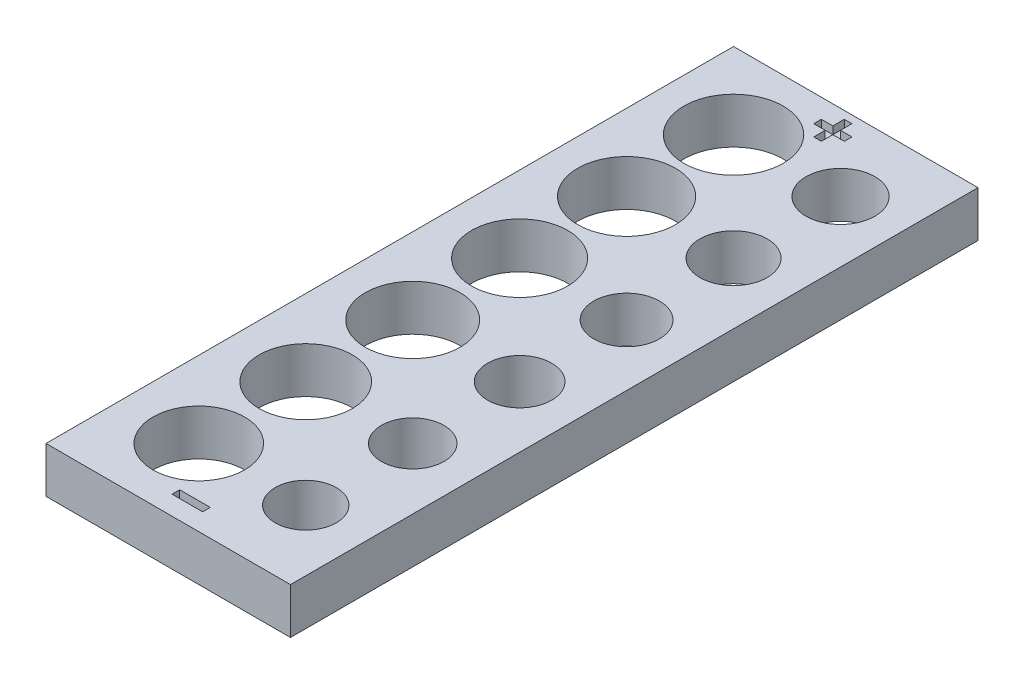
ISO-10303-21;
HEADER;
FILE_DESCRIPTION(('STEP AP214'),'2;1');
FILE_NAME('part.step','',(''),(''),'','','');
FILE_SCHEMA(('AUTOMOTIVE_DESIGN { 1 0 10303 214 1 1 1 1 }'));
ENDSEC;
DATA;
#1=APPLICATION_CONTEXT('core data for automotive mechanical design processes');
#2=APPLICATION_PROTOCOL_DEFINITION('international standard','automotive_design',2000,#1);
#3=PRODUCT_CONTEXT('',#1,'mechanical');
#4=PRODUCT('Part','Part','',(#3));
#5=PRODUCT_RELATED_PRODUCT_CATEGORY('part','',(#4));
#6=PRODUCT_DEFINITION_FORMATION('','',#4);
#7=PRODUCT_DEFINITION_CONTEXT('part definition',#1,'design');
#8=PRODUCT_DEFINITION('design','',#6,#7);
#9=PRODUCT_DEFINITION_SHAPE('','',#8);
#10=(LENGTH_UNIT() NAMED_UNIT(*) SI_UNIT(.MILLI.,.METRE.));
#11=(NAMED_UNIT(*) PLANE_ANGLE_UNIT() SI_UNIT($,.RADIAN.));
#12=(NAMED_UNIT(*) SI_UNIT($,.STERADIAN.) SOLID_ANGLE_UNIT());
#13=UNCERTAINTY_MEASURE_WITH_UNIT(LENGTH_MEASURE(1.E-05),#10,'distance_accuracy_value','');
#14=(GEOMETRIC_REPRESENTATION_CONTEXT(3) GLOBAL_UNCERTAINTY_ASSIGNED_CONTEXT((#13)) GLOBAL_UNIT_ASSIGNED_CONTEXT((#10,
#11,#12)) REPRESENTATION_CONTEXT('',''));
#15=CARTESIAN_POINT('',(0.,0.,0.));
#16=DIRECTION('',(0.,0.,1.));
#17=DIRECTION('',(1.,0.,0.));
#18=AXIS2_PLACEMENT_3D('',#15,#16,#17);
#19=CARTESIAN_POINT('',(0.,3.,0.));
#20=DIRECTION('',(0.,-1.,0.));
#21=DIRECTION('',(0.,0.,-1.));
#22=AXIS2_PLACEMENT_3D('',#19,#20,#21);
#23=PLANE('',#22);
#24=DIRECTION('',(0.,0.,1.));
#25=VECTOR('',#24,1.);
#26=CARTESIAN_POINT('',(7.,3.,-43.25));
#27=LINE('',#26,#25);
#28=CARTESIAN_POINT('',(7.,3.,-43.75));
#29=VERTEX_POINT('',#28);
#30=CARTESIAN_POINT('',(7.,3.,-43.25));
#31=VERTEX_POINT('',#30);
#32=EDGE_CURVE('E257',#29,#31,#27,.T.);
#33=ORIENTED_EDGE('',*,*,#32,.F.);
#34=DIRECTION('',(-1.,0.,0.));
#35=VECTOR('',#34,1.);
#36=CARTESIAN_POINT('',(7.,3.,-43.75));
#37=LINE('',#36,#35);
#38=CARTESIAN_POINT('',(7.75,3.,-43.75));
#39=VERTEX_POINT('',#38);
#40=EDGE_CURVE('E65',#39,#29,#37,.T.);
#41=ORIENTED_EDGE('',*,*,#40,.F.);
#42=DIRECTION('',(0.,0.,1.));
#43=VECTOR('',#42,1.);
#44=CARTESIAN_POINT('',(7.75,3.,-43.75));
#45=LINE('',#44,#43);
#46=CARTESIAN_POINT('',(7.75,3.,-44.5));
#47=VERTEX_POINT('',#46);
#48=EDGE_CURVE('E211',#47,#39,#45,.T.);
#49=ORIENTED_EDGE('',*,*,#48,.F.);
#50=DIRECTION('',(-1.,0.,0.));
#51=VECTOR('',#50,1.);
#52=CARTESIAN_POINT('',(7.75,3.,-44.5));
#53=LINE('',#52,#51);
#54=CARTESIAN_POINT('',(8.25,3.,-44.5));
#55=VERTEX_POINT('',#54);
#56=EDGE_CURVE('E218',#55,#47,#53,.T.);
#57=ORIENTED_EDGE('',*,*,#56,.F.);
#58=DIRECTION('',(0.,0.,-1.));
#59=VECTOR('',#58,1.);
#60=CARTESIAN_POINT('',(8.25,3.,-44.5));
#61=LINE('',#60,#59);
#62=CARTESIAN_POINT('',(8.25,3.,-43.75));
#63=VERTEX_POINT('',#62);
#64=EDGE_CURVE('E288',#63,#55,#61,.T.);
#65=ORIENTED_EDGE('',*,*,#64,.F.);
#66=DIRECTION('',(-1.,0.,0.));
#67=VECTOR('',#66,1.);
#68=CARTESIAN_POINT('',(8.25,3.,-43.75));
#69=LINE('',#68,#67);
#70=CARTESIAN_POINT('',(9.,3.,-43.75));
#71=VERTEX_POINT('',#70);
#72=EDGE_CURVE('E284',#71,#63,#69,.T.);
#73=ORIENTED_EDGE('',*,*,#72,.F.);
#74=DIRECTION('',(0.,0.,-1.));
#75=VECTOR('',#74,1.);
#76=CARTESIAN_POINT('',(9.,3.,-43.75));
#77=LINE('',#76,#75);
#78=CARTESIAN_POINT('',(9.,3.,-43.25));
#79=VERTEX_POINT('',#78);
#80=EDGE_CURVE('E280',#79,#71,#77,.T.);
#81=ORIENTED_EDGE('',*,*,#80,.F.);
#82=DIRECTION('',(1.,0.,0.));
#83=VECTOR('',#82,1.);
#84=CARTESIAN_POINT('',(9.,3.,-43.25));
#85=LINE('',#84,#83);
#86=CARTESIAN_POINT('',(8.25,3.,-43.25));
#87=VERTEX_POINT('',#86);
#88=EDGE_CURVE('E276',#87,#79,#85,.T.);
#89=ORIENTED_EDGE('',*,*,#88,.F.);
#90=DIRECTION('',(0.,0.,-1.));
#91=VECTOR('',#90,1.);
#92=CARTESIAN_POINT('',(8.25,3.,-43.25));
#93=LINE('',#92,#91);
#94=CARTESIAN_POINT('',(8.25,3.,-42.5));
#95=VERTEX_POINT('',#94);
#96=EDGE_CURVE('E272',#95,#87,#93,.T.);
#97=ORIENTED_EDGE('',*,*,#96,.F.);
#98=DIRECTION('',(1.,0.,0.));
#99=VECTOR('',#98,1.);
#100=CARTESIAN_POINT('',(8.25,3.,-42.5));
#101=LINE('',#100,#99);
#102=CARTESIAN_POINT('',(7.75,3.,-42.5));
#103=VERTEX_POINT('',#102);
#104=EDGE_CURVE('E268',#103,#95,#101,.T.);
#105=ORIENTED_EDGE('',*,*,#104,.F.);
#106=DIRECTION('',(0.,0.,1.));
#107=VECTOR('',#106,1.);
#108=CARTESIAN_POINT('',(7.75,3.,-42.5));
#109=LINE('',#108,#107);
#110=CARTESIAN_POINT('',(7.75,3.,-43.25));
#111=VERTEX_POINT('',#110);
#112=EDGE_CURVE('E264',#111,#103,#109,.T.);
#113=ORIENTED_EDGE('',*,*,#112,.F.);
#114=DIRECTION('',(1.,0.,0.));
#115=VECTOR('',#114,1.);
#116=CARTESIAN_POINT('',(7.75,3.,-43.25));
#117=LINE('',#116,#115);
#118=EDGE_CURVE('E260',#31,#111,#117,.T.);
#119=ORIENTED_EDGE('',*,*,#118,.F.);
#120=EDGE_LOOP('',(#33,#41,#49,#57,#65,#73,#81,#89,#97,#105,#113,#119));
#121=FACE_BOUND('',#120,.T.);
#122=DIRECTION('',(-1.,0.,0.));
#123=VECTOR('',#122,1.);
#124=CARTESIAN_POINT('',(7.,3.,-1.75));
#125=LINE('',#124,#123);
#126=CARTESIAN_POINT('',(9.,3.,-1.75));
#127=VERTEX_POINT('',#126);
#128=CARTESIAN_POINT('',(7.,3.,-1.75));
#129=VERTEX_POINT('',#128);
#130=EDGE_CURVE('E350',#127,#129,#125,.T.);
#131=ORIENTED_EDGE('',*,*,#130,.F.);
#132=DIRECTION('',(0.,0.,-1.));
#133=VECTOR('',#132,1.);
#134=CARTESIAN_POINT('',(9.,3.,-1.25));
#135=LINE('',#134,#133);
#136=CARTESIAN_POINT('',(9.,3.,-1.25));
#137=VERTEX_POINT('',#136);
#138=EDGE_CURVE('E73',#137,#127,#135,.T.);
#139=ORIENTED_EDGE('',*,*,#138,.F.);
#140=DIRECTION('',(1.,0.,0.));
#141=VECTOR('',#140,1.);
#142=CARTESIAN_POINT('',(7.,3.,-1.25));
#143=LINE('',#142,#141);
#144=CARTESIAN_POINT('',(7.,3.,-1.25));
#145=VERTEX_POINT('',#144);
#146=EDGE_CURVE('E341',#145,#137,#143,.T.);
#147=ORIENTED_EDGE('',*,*,#146,.F.);
#148=DIRECTION('',(0.,0.,1.));
#149=VECTOR('',#148,1.);
#150=CARTESIAN_POINT('',(7.,3.,-1.25));
#151=LINE('',#150,#149);
#152=EDGE_CURVE('E345',#129,#145,#151,.T.);
#153=ORIENTED_EDGE('',*,*,#152,.F.);
#154=EDGE_LOOP('',(#131,#139,#147,#153));
#155=FACE_BOUND('',#154,.T.);
#156=DIRECTION('',(0.,0.,1.));
#157=VECTOR('',#156,1.);
#158=CARTESIAN_POINT('',(0.,3.,0.));
#159=LINE('',#158,#157);
#160=CARTESIAN_POINT('',(0.,3.,-45.));
#161=VERTEX_POINT('',#160);
#162=CARTESIAN_POINT('',(0.,3.,0.));
#163=VERTEX_POINT('',#162);
#164=EDGE_CURVE('E465',#161,#163,#159,.T.);
#165=ORIENTED_EDGE('',*,*,#164,.T.);
#166=DIRECTION('',(1.,0.,0.));
#167=VECTOR('',#166,1.);
#168=CARTESIAN_POINT('',(0.,3.,0.));
#169=LINE('',#168,#167);
#170=CARTESIAN_POINT('',(16.,3.,0.));
#171=VERTEX_POINT('',#170);
#172=EDGE_CURVE('E469',#163,#171,#169,.T.);
#173=ORIENTED_EDGE('',*,*,#172,.T.);
#174=DIRECTION('',(0.,0.,-1.));
#175=VECTOR('',#174,1.);
#176=CARTESIAN_POINT('',(16.,3.,0.));
#177=LINE('',#176,#175);
#178=CARTESIAN_POINT('',(16.,3.,-45.));
#179=VERTEX_POINT('',#178);
#180=EDGE_CURVE('E473',#171,#179,#177,.T.);
#181=ORIENTED_EDGE('',*,*,#180,.T.);
#182=DIRECTION('',(-1.,0.,0.));
#183=VECTOR('',#182,1.);
#184=CARTESIAN_POINT('',(0.,3.,-45.));
#185=LINE('',#184,#183);
#186=EDGE_CURVE('E476',#179,#161,#185,.T.);
#187=ORIENTED_EDGE('',*,*,#186,.T.);
#188=EDGE_LOOP('',(#165,#173,#181,#187));
#189=FACE_BOUND('',#188,.T.);
#190=CARTESIAN_POINT('',(5.,3.,-12.));
#191=DIRECTION('',(0.,1.,0.));
#192=DIRECTION('',(0.,0.,1.));
#193=AXIS2_PLACEMENT_3D('',#190,#191,#192);
#194=CIRCLE('',#193,3.05);
#195=CARTESIAN_POINT('',(5.,3.,-8.95));
#196=VERTEX_POINT('',#195);
#197=EDGE_CURVE('E457',#196,#196,#194,.T.);
#198=ORIENTED_EDGE('',*,*,#197,.F.);
#199=EDGE_LOOP('',(#198));
#200=FACE_BOUND('',#199,.T.);
#201=CARTESIAN_POINT('',(5.,3.,-5.));
#202=DIRECTION('',(0.,1.,0.));
#203=DIRECTION('',(0.,0.,1.));
#204=AXIS2_PLACEMENT_3D('',#201,#202,#203);
#205=CIRCLE('',#204,3.);
#206=CARTESIAN_POINT('',(5.,3.,-2.));
#207=VERTEX_POINT('',#206);
#208=EDGE_CURVE('E449',#207,#207,#205,.T.);
#209=ORIENTED_EDGE('',*,*,#208,.F.);
#210=EDGE_LOOP('',(#209));
#211=FACE_BOUND('',#210,.T.);
#212=CARTESIAN_POINT('',(5.,3.,-19.));
#213=DIRECTION('',(0.,1.,0.));
#214=DIRECTION('',(0.,0.,1.));
#215=AXIS2_PLACEMENT_3D('',#212,#213,#214);
#216=CIRCLE('',#215,3.1);
#217=CARTESIAN_POINT('',(5.,3.,-15.9));
#218=VERTEX_POINT('',#217);
#219=EDGE_CURVE('E441',#218,#218,#216,.T.);
#220=ORIENTED_EDGE('',*,*,#219,.F.);
#221=EDGE_LOOP('',(#220));
#222=FACE_BOUND('',#221,.T.);
#223=CARTESIAN_POINT('',(5.00000000000001,3.,-26.));
#224=DIRECTION('',(0.,1.,0.));
#225=DIRECTION('',(0.,0.,1.));
#226=AXIS2_PLACEMENT_3D('',#223,#224,#225);
#227=CIRCLE('',#226,3.15);
#228=CARTESIAN_POINT('',(5.00000000000001,3.,-22.85));
#229=VERTEX_POINT('',#228);
#230=EDGE_CURVE('E434',#229,#229,#227,.T.);
#231=ORIENTED_EDGE('',*,*,#230,.F.);
#232=EDGE_LOOP('',(#231));
#233=FACE_BOUND('',#232,.T.);
#234=CARTESIAN_POINT('',(5.00000000000001,3.,-33.));
#235=DIRECTION('',(0.,1.,0.));
#236=DIRECTION('',(0.,0.,1.));
#237=AXIS2_PLACEMENT_3D('',#234,#235,#236);
#238=CIRCLE('',#237,3.2);
#239=CARTESIAN_POINT('',(5.00000000000001,3.,-29.8));
#240=VERTEX_POINT('',#239);
#241=EDGE_CURVE('E426',#240,#240,#238,.T.);
#242=ORIENTED_EDGE('',*,*,#241,.F.);
#243=EDGE_LOOP('',(#242));
#244=FACE_BOUND('',#243,.T.);
#245=CARTESIAN_POINT('',(5.00000000000001,3.,-40.));
#246=DIRECTION('',(0.,1.,0.));
#247=DIRECTION('',(0.,0.,1.));
#248=AXIS2_PLACEMENT_3D('',#245,#246,#247);
#249=CIRCLE('',#248,3.25);
#250=CARTESIAN_POINT('',(5.00000000000001,3.,-36.75));
#251=VERTEX_POINT('',#250);
#252=EDGE_CURVE('E418',#251,#251,#249,.T.);
#253=ORIENTED_EDGE('',*,*,#252,.F.);
#254=EDGE_LOOP('',(#253));
#255=FACE_BOUND('',#254,.T.);
#256=CARTESIAN_POINT('',(12.,3.,-33.));
#257=DIRECTION('',(0.,1.,0.));
#258=DIRECTION('',(0.,0.,1.));
#259=AXIS2_PLACEMENT_3D('',#256,#257,#258);
#260=CIRCLE('',#259,2.2);
#261=CARTESIAN_POINT('',(12.,3.,-30.8));
#262=VERTEX_POINT('',#261);
#263=EDGE_CURVE('E410',#262,#262,#260,.T.);
#264=ORIENTED_EDGE('',*,*,#263,.F.);
#265=EDGE_LOOP('',(#264));
#266=FACE_BOUND('',#265,.T.);
#267=CARTESIAN_POINT('',(12.,3.,-40.));
#268=DIRECTION('',(0.,1.,0.));
#269=DIRECTION('',(0.,0.,1.));
#270=AXIS2_PLACEMENT_3D('',#267,#268,#269);
#271=CIRCLE('',#270,2.25);
#272=CARTESIAN_POINT('',(12.,3.,-37.75));
#273=VERTEX_POINT('',#272);
#274=EDGE_CURVE('E402',#273,#273,#271,.T.);
#275=ORIENTED_EDGE('',*,*,#274,.F.);
#276=EDGE_LOOP('',(#275));
#277=FACE_BOUND('',#276,.T.);
#278=CARTESIAN_POINT('',(12.,3.,-26.));
#279=DIRECTION('',(0.,1.,0.));
#280=DIRECTION('',(0.,0.,1.));
#281=AXIS2_PLACEMENT_3D('',#278,#279,#280);
#282=CIRCLE('',#281,2.15);
#283=CARTESIAN_POINT('',(12.,3.,-23.85));
#284=VERTEX_POINT('',#283);
#285=EDGE_CURVE('E394',#284,#284,#282,.T.);
#286=ORIENTED_EDGE('',*,*,#285,.F.);
#287=EDGE_LOOP('',(#286));
#288=FACE_BOUND('',#287,.T.);
#289=CARTESIAN_POINT('',(12.,3.,-19.));
#290=DIRECTION('',(0.,1.,0.));
#291=DIRECTION('',(0.,0.,1.));
#292=AXIS2_PLACEMENT_3D('',#289,#290,#291);
#293=CIRCLE('',#292,2.1);
#294=CARTESIAN_POINT('',(12.,3.,-16.9));
#295=VERTEX_POINT('',#294);
#296=EDGE_CURVE('E386',#295,#295,#293,.T.);
#297=ORIENTED_EDGE('',*,*,#296,.F.);
#298=EDGE_LOOP('',(#297));
#299=FACE_BOUND('',#298,.T.);
#300=CARTESIAN_POINT('',(12.,3.,-12.));
#301=DIRECTION('',(0.,1.,0.));
#302=DIRECTION('',(0.,0.,1.));
#303=AXIS2_PLACEMENT_3D('',#300,#301,#302);
#304=CIRCLE('',#303,2.05);
#305=CARTESIAN_POINT('',(12.,3.,-9.95));
#306=VERTEX_POINT('',#305);
#307=EDGE_CURVE('E378',#306,#306,#304,.T.);
#308=ORIENTED_EDGE('',*,*,#307,.F.);
#309=EDGE_LOOP('',(#308));
#310=FACE_BOUND('',#309,.T.);
#311=CARTESIAN_POINT('',(12.,3.,-5.));
#312=DIRECTION('',(0.,1.,0.));
#313=DIRECTION('',(0.,0.,1.));
#314=AXIS2_PLACEMENT_3D('',#311,#312,#313);
#315=CIRCLE('',#314,2.);
#316=CARTESIAN_POINT('',(12.,3.,-3.));
#317=VERTEX_POINT('',#316);
#318=EDGE_CURVE('E370',#317,#317,#315,.T.);
#319=ORIENTED_EDGE('',*,*,#318,.F.);
#320=EDGE_LOOP('',(#319));
#321=FACE_BOUND('',#320,.T.);
#322=ADVANCED_FACE('F49',(#121,#155,#189,#200,#211,#222,#233,#244,#255,#266,#277,#288,#299,#310,
#321),#23,.F.);
#323=CARTESIAN_POINT('',(0.,0.,0.));
#324=DIRECTION('',(0.,-1.,0.));
#325=DIRECTION('',(0.,0.,-1.));
#326=AXIS2_PLACEMENT_3D('',#323,#324,#325);
#327=PLANE('',#326);
#328=CARTESIAN_POINT('',(12.,0.,-12.));
#329=DIRECTION('',(0.,1.,0.));
#330=DIRECTION('',(0.,0.,1.));
#331=AXIS2_PLACEMENT_3D('',#328,#329,#330);
#332=CIRCLE('',#331,2.05);
#333=CARTESIAN_POINT('',(12.,0.,-9.95));
#334=VERTEX_POINT('',#333);
#335=EDGE_CURVE('E374',#334,#334,#332,.T.);
#336=ORIENTED_EDGE('',*,*,#335,.T.);
#337=EDGE_LOOP('',(#336));
#338=FACE_BOUND('',#337,.T.);
#339=CARTESIAN_POINT('',(12.,0.,-26.));
#340=DIRECTION('',(0.,1.,0.));
#341=DIRECTION('',(0.,0.,1.));
#342=AXIS2_PLACEMENT_3D('',#339,#340,#341);
#343=CIRCLE('',#342,2.15);
#344=CARTESIAN_POINT('',(12.,0.,-23.85));
#345=VERTEX_POINT('',#344);
#346=EDGE_CURVE('E390',#345,#345,#343,.T.);
#347=ORIENTED_EDGE('',*,*,#346,.T.);
#348=EDGE_LOOP('',(#347));
#349=FACE_BOUND('',#348,.T.);
#350=CARTESIAN_POINT('',(12.,0.,-33.));
#351=DIRECTION('',(0.,1.,0.));
#352=DIRECTION('',(0.,0.,1.));
#353=AXIS2_PLACEMENT_3D('',#350,#351,#352);
#354=CIRCLE('',#353,2.2);
#355=CARTESIAN_POINT('',(12.,0.,-30.8));
#356=VERTEX_POINT('',#355);
#357=EDGE_CURVE('E406',#356,#356,#354,.T.);
#358=ORIENTED_EDGE('',*,*,#357,.T.);
#359=EDGE_LOOP('',(#358));
#360=FACE_BOUND('',#359,.T.);
#361=CARTESIAN_POINT('',(5.00000000000001,0.,-33.));
#362=DIRECTION('',(0.,1.,0.));
#363=DIRECTION('',(0.,0.,1.));
#364=AXIS2_PLACEMENT_3D('',#361,#362,#363);
#365=CIRCLE('',#364,3.2);
#366=CARTESIAN_POINT('',(5.00000000000001,0.,-29.8));
#367=VERTEX_POINT('',#366);
#368=EDGE_CURVE('E422',#367,#367,#365,.T.);
#369=ORIENTED_EDGE('',*,*,#368,.T.);
#370=EDGE_LOOP('',(#369));
#371=FACE_BOUND('',#370,.T.);
#372=CARTESIAN_POINT('',(5.,0.,-19.));
#373=DIRECTION('',(0.,1.,0.));
#374=DIRECTION('',(0.,0.,1.));
#375=AXIS2_PLACEMENT_3D('',#372,#373,#374);
#376=CIRCLE('',#375,3.1);
#377=CARTESIAN_POINT('',(5.,0.,-15.9));
#378=VERTEX_POINT('',#377);
#379=EDGE_CURVE('E437',#378,#378,#376,.T.);
#380=ORIENTED_EDGE('',*,*,#379,.T.);
#381=EDGE_LOOP('',(#380));
#382=FACE_BOUND('',#381,.T.);
#383=CARTESIAN_POINT('',(5.,0.,-12.));
#384=DIRECTION('',(0.,1.,0.));
#385=DIRECTION('',(0.,0.,1.));
#386=AXIS2_PLACEMENT_3D('',#383,#384,#385);
#387=CIRCLE('',#386,3.05);
#388=CARTESIAN_POINT('',(5.,0.,-8.95));
#389=VERTEX_POINT('',#388);
#390=EDGE_CURVE('E453',#389,#389,#387,.T.);
#391=ORIENTED_EDGE('',*,*,#390,.T.);
#392=EDGE_LOOP('',(#391));
#393=FACE_BOUND('',#392,.T.);
#394=DIRECTION('',(0.,0.,1.));
#395=VECTOR('',#394,1.);
#396=CARTESIAN_POINT('',(0.,0.,0.));
#397=LINE('',#396,#395);
#398=CARTESIAN_POINT('',(0.,0.,-45.));
#399=VERTEX_POINT('',#398);
#400=CARTESIAN_POINT('',(0.,0.,0.));
#401=VERTEX_POINT('',#400);
#402=EDGE_CURVE('E461',#399,#401,#397,.T.);
#403=ORIENTED_EDGE('',*,*,#402,.F.);
#404=DIRECTION('',(-1.,0.,0.));
#405=VECTOR('',#404,1.);
#406=CARTESIAN_POINT('',(0.,0.,-45.));
#407=LINE('',#406,#405);
#408=CARTESIAN_POINT('',(16.,0.,-45.));
#409=VERTEX_POINT('',#408);
#410=EDGE_CURVE('E470',#409,#399,#407,.T.);
#411=ORIENTED_EDGE('',*,*,#410,.F.);
#412=DIRECTION('',(0.,0.,-1.));
#413=VECTOR('',#412,1.);
#414=CARTESIAN_POINT('',(16.,0.,0.));
#415=LINE('',#414,#413);
#416=CARTESIAN_POINT('',(16.,0.,0.));
#417=VERTEX_POINT('',#416);
#418=EDGE_CURVE('E486',#417,#409,#415,.T.);
#419=ORIENTED_EDGE('',*,*,#418,.F.);
#420=DIRECTION('',(1.,0.,0.));
#421=VECTOR('',#420,1.);
#422=CARTESIAN_POINT('',(0.,0.,0.));
#423=LINE('',#422,#421);
#424=EDGE_CURVE('E483',#401,#417,#423,.T.);
#425=ORIENTED_EDGE('',*,*,#424,.F.);
#426=EDGE_LOOP('',(#403,#411,#419,#425));
#427=FACE_BOUND('',#426,.T.);
#428=CARTESIAN_POINT('',(5.,0.,-5.));
#429=DIRECTION('',(0.,1.,0.));
#430=DIRECTION('',(0.,0.,1.));
#431=AXIS2_PLACEMENT_3D('',#428,#429,#430);
#432=CIRCLE('',#431,3.);
#433=CARTESIAN_POINT('',(5.,0.,-2.));
#434=VERTEX_POINT('',#433);
#435=EDGE_CURVE('E445',#434,#434,#432,.T.);
#436=ORIENTED_EDGE('',*,*,#435,.T.);
#437=EDGE_LOOP('',(#436));
#438=FACE_BOUND('',#437,.T.);
#439=CARTESIAN_POINT('',(5.00000000000001,0.,-26.));
#440=DIRECTION('',(0.,1.,0.));
#441=DIRECTION('',(0.,0.,1.));
#442=AXIS2_PLACEMENT_3D('',#439,#440,#441);
#443=CIRCLE('',#442,3.15);
#444=CARTESIAN_POINT('',(5.00000000000001,0.,-22.85));
#445=VERTEX_POINT('',#444);
#446=EDGE_CURVE('E430',#445,#445,#443,.T.);
#447=ORIENTED_EDGE('',*,*,#446,.T.);
#448=EDGE_LOOP('',(#447));
#449=FACE_BOUND('',#448,.T.);
#450=CARTESIAN_POINT('',(5.00000000000001,0.,-40.));
#451=DIRECTION('',(0.,1.,0.));
#452=DIRECTION('',(0.,0.,1.));
#453=AXIS2_PLACEMENT_3D('',#450,#451,#452);
#454=CIRCLE('',#453,3.25);
#455=CARTESIAN_POINT('',(5.00000000000001,0.,-36.75));
#456=VERTEX_POINT('',#455);
#457=EDGE_CURVE('E414',#456,#456,#454,.T.);
#458=ORIENTED_EDGE('',*,*,#457,.T.);
#459=EDGE_LOOP('',(#458));
#460=FACE_BOUND('',#459,.T.);
#461=CARTESIAN_POINT('',(12.,0.,-40.));
#462=DIRECTION('',(0.,1.,0.));
#463=DIRECTION('',(0.,0.,1.));
#464=AXIS2_PLACEMENT_3D('',#461,#462,#463);
#465=CIRCLE('',#464,2.25);
#466=CARTESIAN_POINT('',(12.,0.,-37.75));
#467=VERTEX_POINT('',#466);
#468=EDGE_CURVE('E398',#467,#467,#465,.T.);
#469=ORIENTED_EDGE('',*,*,#468,.T.);
#470=EDGE_LOOP('',(#469));
#471=FACE_BOUND('',#470,.T.);
#472=CARTESIAN_POINT('',(12.,0.,-19.));
#473=DIRECTION('',(0.,1.,0.));
#474=DIRECTION('',(0.,0.,1.));
#475=AXIS2_PLACEMENT_3D('',#472,#473,#474);
#476=CIRCLE('',#475,2.1);
#477=CARTESIAN_POINT('',(12.,0.,-16.9));
#478=VERTEX_POINT('',#477);
#479=EDGE_CURVE('E382',#478,#478,#476,.T.);
#480=ORIENTED_EDGE('',*,*,#479,.T.);
#481=EDGE_LOOP('',(#480));
#482=FACE_BOUND('',#481,.T.);
#483=CARTESIAN_POINT('',(12.,0.,-5.));
#484=DIRECTION('',(0.,1.,0.));
#485=DIRECTION('',(0.,0.,1.));
#486=AXIS2_PLACEMENT_3D('',#483,#484,#485);
#487=CIRCLE('',#486,2.);
#488=CARTESIAN_POINT('',(12.,0.,-3.));
#489=VERTEX_POINT('',#488);
#490=EDGE_CURVE('E298',#489,#489,#487,.T.);
#491=ORIENTED_EDGE('',*,*,#490,.T.);
#492=EDGE_LOOP('',(#491));
#493=FACE_BOUND('',#492,.T.);
#494=ADVANCED_FACE('F510',(#338,#349,#360,#371,#382,#393,#427,#438,#449,#460,#471,#482,#493),
#327,.T.);
#495=CARTESIAN_POINT('',(0.,3.,0.));
#496=DIRECTION('',(1.,0.,0.));
#497=DIRECTION('',(0.,0.,-1.));
#498=AXIS2_PLACEMENT_3D('',#495,#496,#497);
#499=PLANE('',#498);
#500=ORIENTED_EDGE('',*,*,#402,.T.);
#501=DIRECTION('',(0.,-1.,0.));
#502=VECTOR('',#501,1.);
#503=CARTESIAN_POINT('',(0.,3.,0.));
#504=LINE('',#503,#502);
#505=EDGE_CURVE('E11',#163,#401,#504,.T.);
#506=ORIENTED_EDGE('',*,*,#505,.F.);
#507=ORIENTED_EDGE('',*,*,#164,.F.);
#508=DIRECTION('',(0.,-1.,0.));
#509=VECTOR('',#508,1.);
#510=CARTESIAN_POINT('',(0.,3.,-45.));
#511=LINE('',#510,#509);
#512=EDGE_CURVE('E479',#161,#399,#511,.T.);
#513=ORIENTED_EDGE('',*,*,#512,.T.);
#514=EDGE_LOOP('',(#500,#506,#507,#513));
#515=FACE_BOUND('',#514,.T.);
#516=ADVANCED_FACE('F51',(#515),#499,.F.);
#517=CARTESIAN_POINT('',(0.,3.,0.));
#518=DIRECTION('',(0.,0.,-1.));
#519=DIRECTION('',(-1.,0.,0.));
#520=AXIS2_PLACEMENT_3D('',#517,#518,#519);
#521=PLANE('',#520);
#522=ORIENTED_EDGE('',*,*,#424,.T.);
#523=DIRECTION('',(0.,-1.,0.));
#524=VECTOR('',#523,1.);
#525=CARTESIAN_POINT('',(16.,3.,0.));
#526=LINE('',#525,#524);
#527=EDGE_CURVE('E58',#171,#417,#526,.T.);
#528=ORIENTED_EDGE('',*,*,#527,.F.);
#529=ORIENTED_EDGE('',*,*,#172,.F.);
#530=ORIENTED_EDGE('',*,*,#505,.T.);
#531=EDGE_LOOP('',(#522,#528,#529,#530));
#532=FACE_BOUND('',#531,.T.);
#533=ADVANCED_FACE('F521',(#532),#521,.F.);
#534=CARTESIAN_POINT('',(16.,3.,0.));
#535=DIRECTION('',(-1.,0.,0.));
#536=DIRECTION('',(0.,0.,1.));
#537=AXIS2_PLACEMENT_3D('',#534,#535,#536);
#538=PLANE('',#537);
#539=ORIENTED_EDGE('',*,*,#418,.T.);
#540=DIRECTION('',(0.,-1.,0.));
#541=VECTOR('',#540,1.);
#542=CARTESIAN_POINT('',(16.,3.,-45.));
#543=LINE('',#542,#541);
#544=EDGE_CURVE('E494',#179,#409,#543,.T.);
#545=ORIENTED_EDGE('',*,*,#544,.F.);
#546=ORIENTED_EDGE('',*,*,#180,.F.);
#547=ORIENTED_EDGE('',*,*,#527,.T.);
#548=EDGE_LOOP('',(#539,#545,#546,#547));
#549=FACE_BOUND('',#548,.T.);
#550=ADVANCED_FACE('F504',(#549),#538,.F.);
#551=CARTESIAN_POINT('',(0.,3.,-45.));
#552=DIRECTION('',(0.,0.,1.));
#553=DIRECTION('',(1.,0.,0.));
#554=AXIS2_PLACEMENT_3D('',#551,#552,#553);
#555=PLANE('',#554);
#556=ORIENTED_EDGE('',*,*,#410,.T.);
#557=ORIENTED_EDGE('',*,*,#512,.F.);
#558=ORIENTED_EDGE('',*,*,#186,.F.);
#559=ORIENTED_EDGE('',*,*,#544,.T.);
#560=EDGE_LOOP('',(#556,#557,#558,#559));
#561=FACE_BOUND('',#560,.T.);
#562=ADVANCED_FACE('F514',(#561),#555,.F.);
#563=CARTESIAN_POINT('',(5.,3.,-12.));
#564=DIRECTION('',(0.,-1.,0.));
#565=DIRECTION('',(0.,0.,-1.));
#566=AXIS2_PLACEMENT_3D('',#563,#564,#565);
#567=CYLINDRICAL_SURFACE('',#566,3.05);
#568=ORIENTED_EDGE('',*,*,#197,.T.);
#569=EDGE_LOOP('',(#568));
#570=FACE_BOUND('',#569,.T.);
#571=ORIENTED_EDGE('',*,*,#390,.F.);
#572=EDGE_LOOP('',(#571));
#573=FACE_BOUND('',#572,.T.);
#574=ADVANCED_FACE('F536',(#570,#573),#567,.F.);
#575=CARTESIAN_POINT('',(5.,3.,-5.));
#576=DIRECTION('',(0.,-1.,0.));
#577=DIRECTION('',(0.,0.,-1.));
#578=AXIS2_PLACEMENT_3D('',#575,#576,#577);
#579=CYLINDRICAL_SURFACE('',#578,3.);
#580=ORIENTED_EDGE('',*,*,#208,.T.);
#581=EDGE_LOOP('',(#580));
#582=FACE_BOUND('',#581,.T.);
#583=ORIENTED_EDGE('',*,*,#435,.F.);
#584=EDGE_LOOP('',(#583));
#585=FACE_BOUND('',#584,.T.);
#586=ADVANCED_FACE('F542',(#582,#585),#579,.F.);
#587=CARTESIAN_POINT('',(5.,3.,-19.));
#588=DIRECTION('',(0.,-1.,0.));
#589=DIRECTION('',(0.,0.,-1.));
#590=AXIS2_PLACEMENT_3D('',#587,#588,#589);
#591=CYLINDRICAL_SURFACE('',#590,3.1);
#592=ORIENTED_EDGE('',*,*,#219,.T.);
#593=EDGE_LOOP('',(#592));
#594=FACE_BOUND('',#593,.T.);
#595=ORIENTED_EDGE('',*,*,#379,.F.);
#596=EDGE_LOOP('',(#595));
#597=FACE_BOUND('',#596,.T.);
#598=ADVANCED_FACE('F546',(#594,#597),#591,.F.);
#599=CARTESIAN_POINT('',(5.00000000000001,3.,-26.));
#600=DIRECTION('',(0.,-1.,0.));
#601=DIRECTION('',(0.,0.,-1.));
#602=AXIS2_PLACEMENT_3D('',#599,#600,#601);
#603=CYLINDRICAL_SURFACE('',#602,3.15);
#604=ORIENTED_EDGE('',*,*,#230,.T.);
#605=EDGE_LOOP('',(#604));
#606=FACE_BOUND('',#605,.T.);
#607=ORIENTED_EDGE('',*,*,#446,.F.);
#608=EDGE_LOOP('',(#607));
#609=FACE_BOUND('',#608,.T.);
#610=ADVANCED_FACE('F617',(#606,#609),#603,.F.);
#611=CARTESIAN_POINT('',(5.00000000000001,3.,-33.));
#612=DIRECTION('',(0.,-1.,0.));
#613=DIRECTION('',(0.,0.,-1.));
#614=AXIS2_PLACEMENT_3D('',#611,#612,#613);
#615=CYLINDRICAL_SURFACE('',#614,3.2);
#616=ORIENTED_EDGE('',*,*,#241,.T.);
#617=EDGE_LOOP('',(#616));
#618=FACE_BOUND('',#617,.T.);
#619=ORIENTED_EDGE('',*,*,#368,.F.);
#620=EDGE_LOOP('',(#619));
#621=FACE_BOUND('',#620,.T.);
#622=ADVANCED_FACE('F613',(#618,#621),#615,.F.);
#623=CARTESIAN_POINT('',(5.00000000000001,3.,-40.));
#624=DIRECTION('',(0.,-1.,0.));
#625=DIRECTION('',(0.,0.,-1.));
#626=AXIS2_PLACEMENT_3D('',#623,#624,#625);
#627=CYLINDRICAL_SURFACE('',#626,3.25);
#628=ORIENTED_EDGE('',*,*,#252,.T.);
#629=EDGE_LOOP('',(#628));
#630=FACE_BOUND('',#629,.T.);
#631=ORIENTED_EDGE('',*,*,#457,.F.);
#632=EDGE_LOOP('',(#631));
#633=FACE_BOUND('',#632,.T.);
#634=ADVANCED_FACE('F609',(#630,#633),#627,.F.);
#635=CARTESIAN_POINT('',(12.,3.,-33.));
#636=DIRECTION('',(0.,-1.,0.));
#637=DIRECTION('',(0.,0.,-1.));
#638=AXIS2_PLACEMENT_3D('',#635,#636,#637);
#639=CYLINDRICAL_SURFACE('',#638,2.2);
#640=ORIENTED_EDGE('',*,*,#263,.T.);
#641=EDGE_LOOP('',(#640));
#642=FACE_BOUND('',#641,.T.);
#643=ORIENTED_EDGE('',*,*,#357,.F.);
#644=EDGE_LOOP('',(#643));
#645=FACE_BOUND('',#644,.T.);
#646=ADVANCED_FACE('F605',(#642,#645),#639,.F.);
#647=CARTESIAN_POINT('',(12.,3.,-40.));
#648=DIRECTION('',(0.,-1.,0.));
#649=DIRECTION('',(0.,0.,-1.));
#650=AXIS2_PLACEMENT_3D('',#647,#648,#649);
#651=CYLINDRICAL_SURFACE('',#650,2.25);
#652=ORIENTED_EDGE('',*,*,#274,.T.);
#653=EDGE_LOOP('',(#652));
#654=FACE_BOUND('',#653,.T.);
#655=ORIENTED_EDGE('',*,*,#468,.F.);
#656=EDGE_LOOP('',(#655));
#657=FACE_BOUND('',#656,.T.);
#658=ADVANCED_FACE('F601',(#654,#657),#651,.F.);
#659=CARTESIAN_POINT('',(12.,3.,-26.));
#660=DIRECTION('',(0.,-1.,0.));
#661=DIRECTION('',(0.,0.,-1.));
#662=AXIS2_PLACEMENT_3D('',#659,#660,#661);
#663=CYLINDRICAL_SURFACE('',#662,2.15);
#664=ORIENTED_EDGE('',*,*,#285,.T.);
#665=EDGE_LOOP('',(#664));
#666=FACE_BOUND('',#665,.T.);
#667=ORIENTED_EDGE('',*,*,#346,.F.);
#668=EDGE_LOOP('',(#667));
#669=FACE_BOUND('',#668,.T.);
#670=ADVANCED_FACE('F597',(#666,#669),#663,.F.);
#671=CARTESIAN_POINT('',(12.,3.,-19.));
#672=DIRECTION('',(0.,-1.,0.));
#673=DIRECTION('',(0.,0.,-1.));
#674=AXIS2_PLACEMENT_3D('',#671,#672,#673);
#675=CYLINDRICAL_SURFACE('',#674,2.1);
#676=ORIENTED_EDGE('',*,*,#296,.T.);
#677=EDGE_LOOP('',(#676));
#678=FACE_BOUND('',#677,.T.);
#679=ORIENTED_EDGE('',*,*,#479,.F.);
#680=EDGE_LOOP('',(#679));
#681=FACE_BOUND('',#680,.T.);
#682=ADVANCED_FACE('F588',(#678,#681),#675,.F.);
#683=CARTESIAN_POINT('',(12.,3.,-12.));
#684=DIRECTION('',(0.,-1.,0.));
#685=DIRECTION('',(0.,0.,-1.));
#686=AXIS2_PLACEMENT_3D('',#683,#684,#685);
#687=CYLINDRICAL_SURFACE('',#686,2.05);
#688=ORIENTED_EDGE('',*,*,#307,.T.);
#689=EDGE_LOOP('',(#688));
#690=FACE_BOUND('',#689,.T.);
#691=ORIENTED_EDGE('',*,*,#335,.F.);
#692=EDGE_LOOP('',(#691));
#693=FACE_BOUND('',#692,.T.);
#694=ADVANCED_FACE('F579',(#690,#693),#687,.F.);
#695=CARTESIAN_POINT('',(12.,3.,-5.));
#696=DIRECTION('',(0.,-1.,0.));
#697=DIRECTION('',(0.,0.,-1.));
#698=AXIS2_PLACEMENT_3D('',#695,#696,#697);
#699=CYLINDRICAL_SURFACE('',#698,2.);
#700=ORIENTED_EDGE('',*,*,#318,.T.);
#701=EDGE_LOOP('',(#700));
#702=FACE_BOUND('',#701,.T.);
#703=ORIENTED_EDGE('',*,*,#490,.F.);
#704=EDGE_LOOP('',(#703));
#705=FACE_BOUND('',#704,.T.);
#706=ADVANCED_FACE('F575',(#702,#705),#699,.F.);
#707=CARTESIAN_POINT('',(9.,2.5,-1.25));
#708=DIRECTION('',(1.,0.,0.));
#709=DIRECTION('',(0.,0.,-1.));
#710=AXIS2_PLACEMENT_3D('',#707,#708,#709);
#711=PLANE('',#710);
#712=ORIENTED_EDGE('',*,*,#138,.T.);
#713=DIRECTION('',(0.,1.,0.));
#714=VECTOR('',#713,1.);
#715=CARTESIAN_POINT('',(9.,2.5,-1.75));
#716=LINE('',#715,#714);
#717=CARTESIAN_POINT('',(9.,2.5,-1.75));
#718=VERTEX_POINT('',#717);
#719=EDGE_CURVE('E328',#718,#127,#716,.T.);
#720=ORIENTED_EDGE('',*,*,#719,.F.);
#721=DIRECTION('',(0.,0.,-1.));
#722=VECTOR('',#721,1.);
#723=CARTESIAN_POINT('',(9.,2.5,-1.25));
#724=LINE('',#723,#722);
#725=CARTESIAN_POINT('',(9.,2.5,-1.25));
#726=VERTEX_POINT('',#725);
#727=EDGE_CURVE('E346',#726,#718,#724,.T.);
#728=ORIENTED_EDGE('',*,*,#727,.F.);
#729=DIRECTION('',(0.,1.,0.));
#730=VECTOR('',#729,1.);
#731=CARTESIAN_POINT('',(9.,2.5,-1.25));
#732=LINE('',#731,#730);
#733=EDGE_CURVE('E338',#726,#137,#732,.T.);
#734=ORIENTED_EDGE('',*,*,#733,.T.);
#735=EDGE_LOOP('',(#712,#720,#728,#734));
#736=FACE_BOUND('',#735,.T.);
#737=ADVANCED_FACE('F578',(#736),#711,.F.);
#738=CARTESIAN_POINT('',(7.,2.5,-1.25));
#739=DIRECTION('',(0.,0.,1.));
#740=DIRECTION('',(1.,0.,0.));
#741=AXIS2_PLACEMENT_3D('',#738,#739,#740);
#742=PLANE('',#741);
#743=ORIENTED_EDGE('',*,*,#146,.T.);
#744=ORIENTED_EDGE('',*,*,#733,.F.);
#745=DIRECTION('',(1.,0.,0.));
#746=VECTOR('',#745,1.);
#747=CARTESIAN_POINT('',(7.,2.5,-1.25));
#748=LINE('',#747,#746);
#749=CARTESIAN_POINT('',(7.,2.5,-1.25));
#750=VERTEX_POINT('',#749);
#751=EDGE_CURVE('E331',#750,#726,#748,.T.);
#752=ORIENTED_EDGE('',*,*,#751,.F.);
#753=DIRECTION('',(0.,1.,0.));
#754=VECTOR('',#753,1.);
#755=CARTESIAN_POINT('',(7.,2.5,-1.25));
#756=LINE('',#755,#754);
#757=EDGE_CURVE('E335',#750,#145,#756,.T.);
#758=ORIENTED_EDGE('',*,*,#757,.T.);
#759=EDGE_LOOP('',(#743,#744,#752,#758));
#760=FACE_BOUND('',#759,.T.);
#761=ADVANCED_FACE('F586',(#760),#742,.F.);
#762=CARTESIAN_POINT('',(7.,2.5,-1.25));
#763=DIRECTION('',(-1.,0.,0.));
#764=DIRECTION('',(0.,0.,1.));
#765=AXIS2_PLACEMENT_3D('',#762,#763,#764);
#766=PLANE('',#765);
#767=ORIENTED_EDGE('',*,*,#152,.T.);
#768=ORIENTED_EDGE('',*,*,#757,.F.);
#769=DIRECTION('',(0.,0.,1.));
#770=VECTOR('',#769,1.);
#771=CARTESIAN_POINT('',(7.,2.5,-1.25));
#772=LINE('',#771,#770);
#773=CARTESIAN_POINT('',(7.,2.5,-1.75));
#774=VERTEX_POINT('',#773);
#775=EDGE_CURVE('E359',#774,#750,#772,.T.);
#776=ORIENTED_EDGE('',*,*,#775,.F.);
#777=DIRECTION('',(0.,1.,0.));
#778=VECTOR('',#777,1.);
#779=CARTESIAN_POINT('',(7.,2.5,-1.75));
#780=LINE('',#779,#778);
#781=EDGE_CURVE('E332',#774,#129,#780,.T.);
#782=ORIENTED_EDGE('',*,*,#781,.T.);
#783=EDGE_LOOP('',(#767,#768,#776,#782));
#784=FACE_BOUND('',#783,.T.);
#785=ADVANCED_FACE('F680',(#784),#766,.F.);
#786=CARTESIAN_POINT('',(7.,2.5,-1.75));
#787=DIRECTION('',(0.,0.,-1.));
#788=DIRECTION('',(-1.,0.,0.));
#789=AXIS2_PLACEMENT_3D('',#786,#787,#788);
#790=PLANE('',#789);
#791=ORIENTED_EDGE('',*,*,#130,.T.);
#792=ORIENTED_EDGE('',*,*,#781,.F.);
#793=DIRECTION('',(-1.,0.,0.));
#794=VECTOR('',#793,1.);
#795=CARTESIAN_POINT('',(7.,2.5,-1.75));
#796=LINE('',#795,#794);
#797=EDGE_CURVE('E363',#718,#774,#796,.T.);
#798=ORIENTED_EDGE('',*,*,#797,.F.);
#799=ORIENTED_EDGE('',*,*,#719,.T.);
#800=EDGE_LOOP('',(#791,#792,#798,#799));
#801=FACE_BOUND('',#800,.T.);
#802=ADVANCED_FACE('F689',(#801),#790,.F.);
#803=CARTESIAN_POINT('',(0.,2.5,0.));
#804=DIRECTION('',(0.,-1.,0.));
#805=DIRECTION('',(0.,0.,-1.));
#806=AXIS2_PLACEMENT_3D('',#803,#804,#805);
#807=PLANE('',#806);
#808=ORIENTED_EDGE('',*,*,#727,.T.);
#809=ORIENTED_EDGE('',*,*,#797,.T.);
#810=ORIENTED_EDGE('',*,*,#775,.T.);
#811=ORIENTED_EDGE('',*,*,#751,.T.);
#812=EDGE_LOOP('',(#808,#809,#810,#811));
#813=FACE_BOUND('',#812,.T.);
#814=ADVANCED_FACE('F592',(#813),#807,.F.);
#815=CARTESIAN_POINT('',(7.,2.5,-43.75));
#816=DIRECTION('',(0.,0.,-1.));
#817=DIRECTION('',(-1.,0.,0.));
#818=AXIS2_PLACEMENT_3D('',#815,#816,#817);
#819=PLANE('',#818);
#820=ORIENTED_EDGE('',*,*,#40,.T.);
#821=DIRECTION('',(0.,1.,0.));
#822=VECTOR('',#821,1.);
#823=CARTESIAN_POINT('',(7.,2.5,-43.75));
#824=LINE('',#823,#822);
#825=CARTESIAN_POINT('',(7.,2.5,-43.75));
#826=VERTEX_POINT('',#825);
#827=EDGE_CURVE('E185',#826,#29,#824,.T.);
#828=ORIENTED_EDGE('',*,*,#827,.F.);
#829=DIRECTION('',(-1.,0.,0.));
#830=VECTOR('',#829,1.);
#831=CARTESIAN_POINT('',(7.,2.5,-43.75));
#832=LINE('',#831,#830);
#833=CARTESIAN_POINT('',(7.75,2.5,-43.75));
#834=VERTEX_POINT('',#833);
#835=EDGE_CURVE('E189',#834,#826,#832,.T.);
#836=ORIENTED_EDGE('',*,*,#835,.F.);
#837=DIRECTION('',(0.,1.,0.));
#838=VECTOR('',#837,1.);
#839=CARTESIAN_POINT('',(7.75,2.5,-43.75));
#840=LINE('',#839,#838);
#841=EDGE_CURVE('E295',#834,#39,#840,.T.);
#842=ORIENTED_EDGE('',*,*,#841,.T.);
#843=EDGE_LOOP('',(#820,#828,#836,#842));
#844=FACE_BOUND('',#843,.T.);
#845=ADVANCED_FACE('F187',(#844),#819,.F.);
#846=CARTESIAN_POINT('',(7.75,2.5,-43.75));
#847=DIRECTION('',(-1.,0.,0.));
#848=DIRECTION('',(0.,0.,1.));
#849=AXIS2_PLACEMENT_3D('',#846,#847,#848);
#850=PLANE('',#849);
#851=ORIENTED_EDGE('',*,*,#48,.T.);
#852=ORIENTED_EDGE('',*,*,#841,.F.);
#853=DIRECTION('',(0.,0.,1.));
#854=VECTOR('',#853,1.);
#855=CARTESIAN_POINT('',(7.75,2.5,-43.75));
#856=LINE('',#855,#854);
#857=CARTESIAN_POINT('',(7.75,2.5,-44.5));
#858=VERTEX_POINT('',#857);
#859=EDGE_CURVE('E196',#858,#834,#856,.T.);
#860=ORIENTED_EDGE('',*,*,#859,.F.);
#861=DIRECTION('',(0.,1.,0.));
#862=VECTOR('',#861,1.);
#863=CARTESIAN_POINT('',(7.75,2.5,-44.5));
#864=LINE('',#863,#862);
#865=EDGE_CURVE('E299',#858,#47,#864,.T.);
#866=ORIENTED_EDGE('',*,*,#865,.T.);
#867=EDGE_LOOP('',(#851,#852,#860,#866));
#868=FACE_BOUND('',#867,.T.);
#869=ADVANCED_FACE('F716',(#868),#850,.F.);
#870=CARTESIAN_POINT('',(7.75,2.5,-44.5));
#871=DIRECTION('',(0.,0.,-1.));
#872=DIRECTION('',(-1.,0.,0.));
#873=AXIS2_PLACEMENT_3D('',#870,#871,#872);
#874=PLANE('',#873);
#875=ORIENTED_EDGE('',*,*,#56,.T.);
#876=ORIENTED_EDGE('',*,*,#865,.F.);
#877=DIRECTION('',(-1.,0.,0.));
#878=VECTOR('',#877,1.);
#879=CARTESIAN_POINT('',(7.75,2.5,-44.5));
#880=LINE('',#879,#878);
#881=CARTESIAN_POINT('',(8.25,2.5,-44.5));
#882=VERTEX_POINT('',#881);
#883=EDGE_CURVE('E251',#882,#858,#880,.T.);
#884=ORIENTED_EDGE('',*,*,#883,.F.);
#885=DIRECTION('',(0.,1.,0.));
#886=VECTOR('',#885,1.);
#887=CARTESIAN_POINT('',(8.25,2.5,-44.5));
#888=LINE('',#887,#886);
#889=EDGE_CURVE('E302',#882,#55,#888,.T.);
#890=ORIENTED_EDGE('',*,*,#889,.T.);
#891=EDGE_LOOP('',(#875,#876,#884,#890));
#892=FACE_BOUND('',#891,.T.);
#893=ADVANCED_FACE('F725',(#892),#874,.F.);
#894=CARTESIAN_POINT('',(8.25,2.5,-44.5));
#895=DIRECTION('',(1.,0.,0.));
#896=DIRECTION('',(0.,0.,-1.));
#897=AXIS2_PLACEMENT_3D('',#894,#895,#896);
#898=PLANE('',#897);
#899=ORIENTED_EDGE('',*,*,#64,.T.);
#900=ORIENTED_EDGE('',*,*,#889,.F.);
#901=DIRECTION('',(0.,0.,-1.));
#902=VECTOR('',#901,1.);
#903=CARTESIAN_POINT('',(8.25,2.5,-44.5));
#904=LINE('',#903,#902);
#905=CARTESIAN_POINT('',(8.25,2.5,-43.75));
#906=VERTEX_POINT('',#905);
#907=EDGE_CURVE('E247',#906,#882,#904,.T.);
#908=ORIENTED_EDGE('',*,*,#907,.F.);
#909=DIRECTION('',(0.,1.,0.));
#910=VECTOR('',#909,1.);
#911=CARTESIAN_POINT('',(8.25,2.5,-43.75));
#912=LINE('',#911,#910);
#913=EDGE_CURVE('E305',#906,#63,#912,.T.);
#914=ORIENTED_EDGE('',*,*,#913,.T.);
#915=EDGE_LOOP('',(#899,#900,#908,#914));
#916=FACE_BOUND('',#915,.T.);
#917=ADVANCED_FACE('F735',(#916),#898,.F.);
#918=CARTESIAN_POINT('',(8.25,2.5,-43.75));
#919=DIRECTION('',(0.,0.,-1.));
#920=DIRECTION('',(-1.,0.,0.));
#921=AXIS2_PLACEMENT_3D('',#918,#919,#920);
#922=PLANE('',#921);
#923=ORIENTED_EDGE('',*,*,#72,.T.);
#924=ORIENTED_EDGE('',*,*,#913,.F.);
#925=DIRECTION('',(-1.,0.,0.));
#926=VECTOR('',#925,1.);
#927=CARTESIAN_POINT('',(8.25,2.5,-43.75));
#928=LINE('',#927,#926);
#929=CARTESIAN_POINT('',(9.,2.5,-43.75));
#930=VERTEX_POINT('',#929);
#931=EDGE_CURVE('E243',#930,#906,#928,.T.);
#932=ORIENTED_EDGE('',*,*,#931,.F.);
#933=DIRECTION('',(0.,1.,0.));
#934=VECTOR('',#933,1.);
#935=CARTESIAN_POINT('',(9.,2.5,-43.75));
#936=LINE('',#935,#934);
#937=EDGE_CURVE('E308',#930,#71,#936,.T.);
#938=ORIENTED_EDGE('',*,*,#937,.T.);
#939=EDGE_LOOP('',(#923,#924,#932,#938));
#940=FACE_BOUND('',#939,.T.);
#941=ADVANCED_FACE('F745',(#940),#922,.F.);
#942=CARTESIAN_POINT('',(9.,2.5,-43.75));
#943=DIRECTION('',(1.,0.,0.));
#944=DIRECTION('',(0.,0.,-1.));
#945=AXIS2_PLACEMENT_3D('',#942,#943,#944);
#946=PLANE('',#945);
#947=ORIENTED_EDGE('',*,*,#80,.T.);
#948=ORIENTED_EDGE('',*,*,#937,.F.);
#949=DIRECTION('',(0.,0.,-1.));
#950=VECTOR('',#949,1.);
#951=CARTESIAN_POINT('',(9.,2.5,-43.75));
#952=LINE('',#951,#950);
#953=CARTESIAN_POINT('',(9.,2.5,-43.25));
#954=VERTEX_POINT('',#953);
#955=EDGE_CURVE('E239',#954,#930,#952,.T.);
#956=ORIENTED_EDGE('',*,*,#955,.F.);
#957=DIRECTION('',(0.,1.,0.));
#958=VECTOR('',#957,1.);
#959=CARTESIAN_POINT('',(9.,2.5,-43.25));
#960=LINE('',#959,#958);
#961=EDGE_CURVE('E311',#954,#79,#960,.T.);
#962=ORIENTED_EDGE('',*,*,#961,.T.);
#963=EDGE_LOOP('',(#947,#948,#956,#962));
#964=FACE_BOUND('',#963,.T.);
#965=ADVANCED_FACE('F755',(#964),#946,.F.);
#966=CARTESIAN_POINT('',(9.,2.5,-43.25));
#967=DIRECTION('',(0.,0.,1.));
#968=DIRECTION('',(1.,0.,0.));
#969=AXIS2_PLACEMENT_3D('',#966,#967,#968);
#970=PLANE('',#969);
#971=ORIENTED_EDGE('',*,*,#88,.T.);
#972=ORIENTED_EDGE('',*,*,#961,.F.);
#973=DIRECTION('',(1.,0.,0.));
#974=VECTOR('',#973,1.);
#975=CARTESIAN_POINT('',(9.,2.5,-43.25));
#976=LINE('',#975,#974);
#977=CARTESIAN_POINT('',(8.25,2.5,-43.25));
#978=VERTEX_POINT('',#977);
#979=EDGE_CURVE('E235',#978,#954,#976,.T.);
#980=ORIENTED_EDGE('',*,*,#979,.F.);
#981=DIRECTION('',(0.,1.,0.));
#982=VECTOR('',#981,1.);
#983=CARTESIAN_POINT('',(8.25,2.5,-43.25));
#984=LINE('',#983,#982);
#985=EDGE_CURVE('E314',#978,#87,#984,.T.);
#986=ORIENTED_EDGE('',*,*,#985,.T.);
#987=EDGE_LOOP('',(#971,#972,#980,#986));
#988=FACE_BOUND('',#987,.T.);
#989=ADVANCED_FACE('F765',(#988),#970,.F.);
#990=CARTESIAN_POINT('',(8.25,2.5,-43.25));
#991=DIRECTION('',(1.,0.,0.));
#992=DIRECTION('',(0.,0.,-1.));
#993=AXIS2_PLACEMENT_3D('',#990,#991,#992);
#994=PLANE('',#993);
#995=ORIENTED_EDGE('',*,*,#96,.T.);
#996=ORIENTED_EDGE('',*,*,#985,.F.);
#997=DIRECTION('',(0.,0.,-1.));
#998=VECTOR('',#997,1.);
#999=CARTESIAN_POINT('',(8.25,2.5,-43.25));
#1000=LINE('',#999,#998);
#1001=CARTESIAN_POINT('',(8.25,2.5,-42.5));
#1002=VERTEX_POINT('',#1001);
#1003=EDGE_CURVE('E231',#1002,#978,#1000,.T.);
#1004=ORIENTED_EDGE('',*,*,#1003,.F.);
#1005=DIRECTION('',(0.,1.,0.));
#1006=VECTOR('',#1005,1.);
#1007=CARTESIAN_POINT('',(8.25,2.5,-42.5));
#1008=LINE('',#1007,#1006);
#1009=EDGE_CURVE('E317',#1002,#95,#1008,.T.);
#1010=ORIENTED_EDGE('',*,*,#1009,.T.);
#1011=EDGE_LOOP('',(#995,#996,#1004,#1010));
#1012=FACE_BOUND('',#1011,.T.);
#1013=ADVANCED_FACE('F775',(#1012),#994,.F.);
#1014=CARTESIAN_POINT('',(8.25,2.5,-42.5));
#1015=DIRECTION('',(0.,0.,1.));
#1016=DIRECTION('',(1.,0.,0.));
#1017=AXIS2_PLACEMENT_3D('',#1014,#1015,#1016);
#1018=PLANE('',#1017);
#1019=ORIENTED_EDGE('',*,*,#104,.T.);
#1020=ORIENTED_EDGE('',*,*,#1009,.F.);
#1021=DIRECTION('',(1.,0.,0.));
#1022=VECTOR('',#1021,1.);
#1023=CARTESIAN_POINT('',(8.25,2.5,-42.5));
#1024=LINE('',#1023,#1022);
#1025=CARTESIAN_POINT('',(7.75,2.5,-42.5));
#1026=VERTEX_POINT('',#1025);
#1027=EDGE_CURVE('E227',#1026,#1002,#1024,.T.);
#1028=ORIENTED_EDGE('',*,*,#1027,.F.);
#1029=DIRECTION('',(0.,1.,0.));
#1030=VECTOR('',#1029,1.);
#1031=CARTESIAN_POINT('',(7.75,2.5,-42.5));
#1032=LINE('',#1031,#1030);
#1033=EDGE_CURVE('E320',#1026,#103,#1032,.T.);
#1034=ORIENTED_EDGE('',*,*,#1033,.T.);
#1035=EDGE_LOOP('',(#1019,#1020,#1028,#1034));
#1036=FACE_BOUND('',#1035,.T.);
#1037=ADVANCED_FACE('F785',(#1036),#1018,.F.);
#1038=CARTESIAN_POINT('',(7.75,2.5,-42.5));
#1039=DIRECTION('',(-1.,0.,0.));
#1040=DIRECTION('',(0.,0.,1.));
#1041=AXIS2_PLACEMENT_3D('',#1038,#1039,#1040);
#1042=PLANE('',#1041);
#1043=ORIENTED_EDGE('',*,*,#112,.T.);
#1044=ORIENTED_EDGE('',*,*,#1033,.F.);
#1045=DIRECTION('',(0.,0.,1.));
#1046=VECTOR('',#1045,1.);
#1047=CARTESIAN_POINT('',(7.75,2.5,-42.5));
#1048=LINE('',#1047,#1046);
#1049=CARTESIAN_POINT('',(7.75,2.5,-43.25));
#1050=VERTEX_POINT('',#1049);
#1051=EDGE_CURVE('E223',#1050,#1026,#1048,.T.);
#1052=ORIENTED_EDGE('',*,*,#1051,.F.);
#1053=DIRECTION('',(0.,1.,0.));
#1054=VECTOR('',#1053,1.);
#1055=CARTESIAN_POINT('',(7.75,2.5,-43.25));
#1056=LINE('',#1055,#1054);
#1057=EDGE_CURVE('E323',#1050,#111,#1056,.T.);
#1058=ORIENTED_EDGE('',*,*,#1057,.T.);
#1059=EDGE_LOOP('',(#1043,#1044,#1052,#1058));
#1060=FACE_BOUND('',#1059,.T.);
#1061=ADVANCED_FACE('F795',(#1060),#1042,.F.);
#1062=CARTESIAN_POINT('',(7.75,2.5,-43.25));
#1063=DIRECTION('',(0.,0.,1.));
#1064=DIRECTION('',(1.,0.,0.));
#1065=AXIS2_PLACEMENT_3D('',#1062,#1063,#1064);
#1066=PLANE('',#1065);
#1067=ORIENTED_EDGE('',*,*,#118,.T.);
#1068=ORIENTED_EDGE('',*,*,#1057,.F.);
#1069=DIRECTION('',(1.,0.,0.));
#1070=VECTOR('',#1069,1.);
#1071=CARTESIAN_POINT('',(7.75,2.5,-43.25));
#1072=LINE('',#1071,#1070);
#1073=CARTESIAN_POINT('',(7.,2.5,-43.25));
#1074=VERTEX_POINT('',#1073);
#1075=EDGE_CURVE('E205',#1074,#1050,#1072,.T.);
#1076=ORIENTED_EDGE('',*,*,#1075,.F.);
#1077=DIRECTION('',(0.,1.,0.));
#1078=VECTOR('',#1077,1.);
#1079=CARTESIAN_POINT('',(7.,2.5,-43.25));
#1080=LINE('',#1079,#1078);
#1081=EDGE_CURVE('E195',#1074,#31,#1080,.T.);
#1082=ORIENTED_EDGE('',*,*,#1081,.T.);
#1083=EDGE_LOOP('',(#1067,#1068,#1076,#1082));
#1084=FACE_BOUND('',#1083,.T.);
#1085=ADVANCED_FACE('F805',(#1084),#1066,.F.);
#1086=CARTESIAN_POINT('',(7.,2.5,-43.25));
#1087=DIRECTION('',(-1.,0.,0.));
#1088=DIRECTION('',(0.,0.,1.));
#1089=AXIS2_PLACEMENT_3D('',#1086,#1087,#1088);
#1090=PLANE('',#1089);
#1091=ORIENTED_EDGE('',*,*,#32,.T.);
#1092=ORIENTED_EDGE('',*,*,#1081,.F.);
#1093=DIRECTION('',(0.,0.,1.));
#1094=VECTOR('',#1093,1.);
#1095=CARTESIAN_POINT('',(7.,2.5,-43.25));
#1096=LINE('',#1095,#1094);
#1097=EDGE_CURVE('E199',#826,#1074,#1096,.T.);
#1098=ORIENTED_EDGE('',*,*,#1097,.F.);
#1099=ORIENTED_EDGE('',*,*,#827,.T.);
#1100=EDGE_LOOP('',(#1091,#1092,#1098,#1099));
#1101=FACE_BOUND('',#1100,.T.);
#1102=ADVANCED_FACE('F200',(#1101),#1090,.F.);
#1103=CARTESIAN_POINT('',(0.,2.5,0.));
#1104=DIRECTION('',(0.,1.,0.));
#1105=DIRECTION('',(0.,0.,1.));
#1106=AXIS2_PLACEMENT_3D('',#1103,#1104,#1105);
#1107=PLANE('',#1106);
#1108=ORIENTED_EDGE('',*,*,#835,.T.);
#1109=ORIENTED_EDGE('',*,*,#1097,.T.);
#1110=ORIENTED_EDGE('',*,*,#1075,.T.);
#1111=ORIENTED_EDGE('',*,*,#1051,.T.);
#1112=ORIENTED_EDGE('',*,*,#1027,.T.);
#1113=ORIENTED_EDGE('',*,*,#1003,.T.);
#1114=ORIENTED_EDGE('',*,*,#979,.T.);
#1115=ORIENTED_EDGE('',*,*,#955,.T.);
#1116=ORIENTED_EDGE('',*,*,#931,.T.);
#1117=ORIENTED_EDGE('',*,*,#907,.T.);
#1118=ORIENTED_EDGE('',*,*,#883,.T.);
#1119=ORIENTED_EDGE('',*,*,#859,.T.);
#1120=EDGE_LOOP('',(#1108,#1109,#1110,#1111,#1112,#1113,#1114,#1115,#1116,#1117,#1118,#1119));
#1121=FACE_BOUND('',#1120,.T.);
#1122=ADVANCED_FACE('F207',(#1121),#1107,.T.);
#1123=CLOSED_SHELL('',(#322,#494,#516,#533,#550,#562,#574,#586,#598,#610,#622,#634,#646,#658,
#670,#682,#694,#706,#737,#761,#785,#802,#814,#845,#869,#893,#917,#941,#965,#989,#1013,#1037,
#1061,#1085,#1102,#1122));
#1124=MANIFOLD_SOLID_BREP('B2',#1123);
#1125=ADVANCED_BREP_SHAPE_REPRESENTATION('',(#18,#1124),#14);
#1126=SHAPE_DEFINITION_REPRESENTATION(#9,#1125);
ENDSEC;
END-ISO-10303-21;
